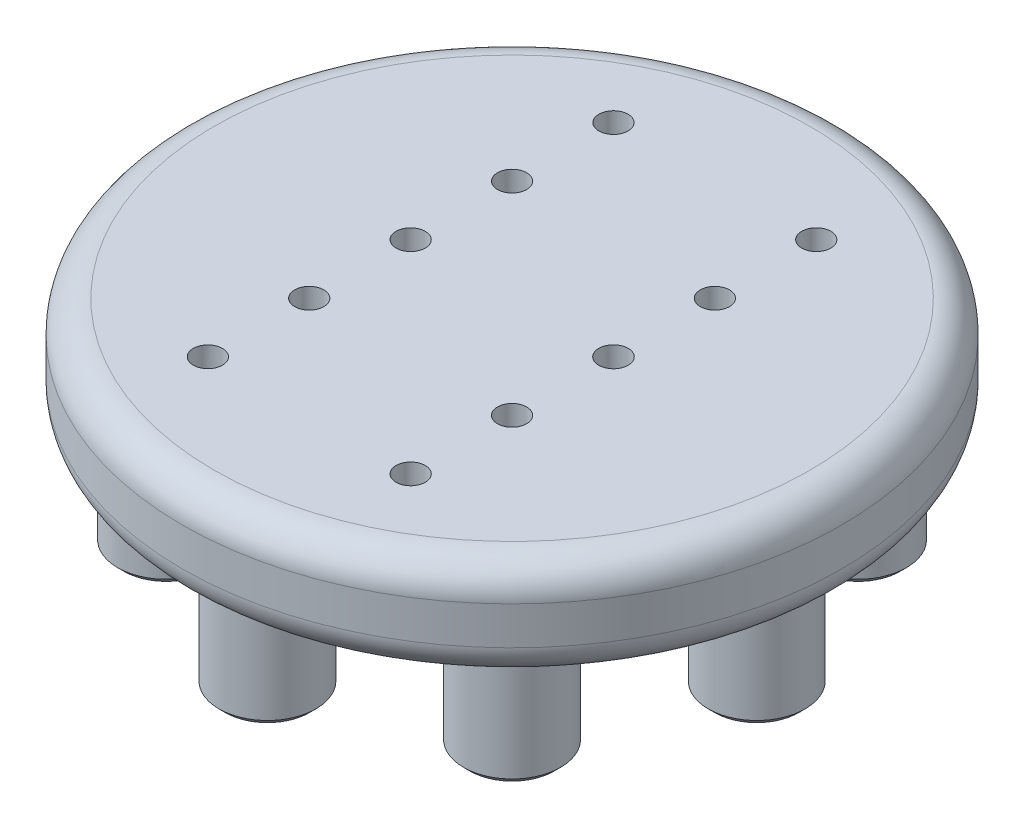
ISO-10303-21;
HEADER;
FILE_DESCRIPTION(('STEP AP214'),'2;1');
FILE_NAME('part.step','',(''),(''),'','','');
FILE_SCHEMA(('AUTOMOTIVE_DESIGN { 1 0 10303 214 1 1 1 1 }'));
ENDSEC;
DATA;
#1=APPLICATION_CONTEXT('core data for automotive mechanical design processes');
#2=APPLICATION_PROTOCOL_DEFINITION('international standard','automotive_design',2000,#1);
#3=PRODUCT_CONTEXT('',#1,'mechanical');
#4=PRODUCT('Part','Part','',(#3));
#5=PRODUCT_RELATED_PRODUCT_CATEGORY('part','',(#4));
#6=PRODUCT_DEFINITION_FORMATION('','',#4);
#7=PRODUCT_DEFINITION_CONTEXT('part definition',#1,'design');
#8=PRODUCT_DEFINITION('design','',#6,#7);
#9=PRODUCT_DEFINITION_SHAPE('','',#8);
#10=(LENGTH_UNIT() NAMED_UNIT(*) SI_UNIT(.MILLI.,.METRE.));
#11=(NAMED_UNIT(*) PLANE_ANGLE_UNIT() SI_UNIT($,.RADIAN.));
#12=(NAMED_UNIT(*) SI_UNIT($,.STERADIAN.) SOLID_ANGLE_UNIT());
#13=UNCERTAINTY_MEASURE_WITH_UNIT(LENGTH_MEASURE(1.E-05),#10,'distance_accuracy_value','');
#14=(GEOMETRIC_REPRESENTATION_CONTEXT(3) GLOBAL_UNCERTAINTY_ASSIGNED_CONTEXT((#13)) GLOBAL_UNIT_ASSIGNED_CONTEXT((#10,
#11,#12)) REPRESENTATION_CONTEXT('',''));
#15=CARTESIAN_POINT('',(0.,0.,0.));
#16=DIRECTION('',(0.,0.,1.));
#17=DIRECTION('',(1.,0.,0.));
#18=AXIS2_PLACEMENT_3D('',#15,#16,#17);
#19=CARTESIAN_POINT('',(0.,8.,0.));
#20=DIRECTION('',(0.,-1.,0.));
#21=DIRECTION('',(0.,0.,-1.));
#22=AXIS2_PLACEMENT_3D('',#19,#20,#21);
#23=CYLINDRICAL_SURFACE('',#22,26.);
#24=CARTESIAN_POINT('',(0.,2.5,0.));
#25=DIRECTION('',(0.,1.,0.));
#26=DIRECTION('',(0.,0.,1.));
#27=AXIS2_PLACEMENT_3D('',#24,#25,#26);
#28=CIRCLE('',#27,26.);
#29=CARTESIAN_POINT('',(0.,2.5,26.));
#30=VERTEX_POINT('',#29);
#31=EDGE_CURVE('E102',#30,#30,#28,.T.);
#32=ORIENTED_EDGE('',*,*,#31,.T.);
#33=EDGE_LOOP('',(#32));
#34=FACE_BOUND('',#33,.T.);
#35=CARTESIAN_POINT('',(0.,5.5,0.));
#36=DIRECTION('',(0.,1.,0.));
#37=DIRECTION('',(0.,0.,1.));
#38=AXIS2_PLACEMENT_3D('',#35,#36,#37);
#39=CIRCLE('',#38,26.);
#40=CARTESIAN_POINT('',(0.,5.5,26.));
#41=VERTEX_POINT('',#40);
#42=EDGE_CURVE('E105',#41,#41,#39,.F.);
#43=ORIENTED_EDGE('',*,*,#42,.T.);
#44=EDGE_LOOP('',(#43));
#45=FACE_BOUND('',#44,.T.);
#46=ADVANCED_FACE('F39',(#34,#45),#23,.T.);
#47=CARTESIAN_POINT('',(0.,8.,0.));
#48=DIRECTION('',(0.,1.,0.));
#49=DIRECTION('',(0.,0.,1.));
#50=AXIS2_PLACEMENT_3D('',#47,#48,#49);
#51=PLANE('',#50);
#52=CARTESIAN_POINT('',(8.,8.,8.));
#53=DIRECTION('',(0.,1.,0.));
#54=DIRECTION('',(0.,0.,1.));
#55=AXIS2_PLACEMENT_3D('',#52,#53,#54);
#56=CIRCLE('',#55,1.15);
#57=CARTESIAN_POINT('',(8.,8.,9.15));
#58=VERTEX_POINT('',#57);
#59=EDGE_CURVE('E161',#58,#58,#56,.T.);
#60=ORIENTED_EDGE('',*,*,#59,.F.);
#61=EDGE_LOOP('',(#60));
#62=FACE_BOUND('',#61,.T.);
#63=CARTESIAN_POINT('',(-8.,8.,16.));
#64=DIRECTION('',(0.,1.,0.));
#65=DIRECTION('',(0.,0.,1.));
#66=AXIS2_PLACEMENT_3D('',#63,#64,#65);
#67=CIRCLE('',#66,1.15);
#68=CARTESIAN_POINT('',(-8.,8.,17.15));
#69=VERTEX_POINT('',#68);
#70=EDGE_CURVE('E172',#69,#69,#67,.T.);
#71=ORIENTED_EDGE('',*,*,#70,.F.);
#72=EDGE_LOOP('',(#71));
#73=FACE_BOUND('',#72,.T.);
#74=CARTESIAN_POINT('',(8.,8.,16.));
#75=DIRECTION('',(0.,1.,0.));
#76=DIRECTION('',(0.,0.,1.));
#77=AXIS2_PLACEMENT_3D('',#74,#75,#76);
#78=CIRCLE('',#77,1.15);
#79=CARTESIAN_POINT('',(8.,8.,17.15));
#80=VERTEX_POINT('',#79);
#81=EDGE_CURVE('E173',#80,#80,#78,.T.);
#82=ORIENTED_EDGE('',*,*,#81,.F.);
#83=EDGE_LOOP('',(#82));
#84=FACE_BOUND('',#83,.T.);
#85=CARTESIAN_POINT('',(-8.,8.,0.));
#86=DIRECTION('',(0.,1.,0.));
#87=DIRECTION('',(0.,0.,1.));
#88=AXIS2_PLACEMENT_3D('',#85,#86,#87);
#89=CIRCLE('',#88,1.15);
#90=CARTESIAN_POINT('',(-8.,8.,1.15));
#91=VERTEX_POINT('',#90);
#92=EDGE_CURVE('E184',#91,#91,#89,.T.);
#93=ORIENTED_EDGE('',*,*,#92,.F.);
#94=EDGE_LOOP('',(#93));
#95=FACE_BOUND('',#94,.T.);
#96=CARTESIAN_POINT('',(-8.,8.,-8.));
#97=DIRECTION('',(0.,1.,0.));
#98=DIRECTION('',(0.,0.,1.));
#99=AXIS2_PLACEMENT_3D('',#96,#97,#98);
#100=CIRCLE('',#99,1.15);
#101=CARTESIAN_POINT('',(-8.,8.,-6.85));
#102=VERTEX_POINT('',#101);
#103=EDGE_CURVE('E142',#102,#102,#100,.T.);
#104=ORIENTED_EDGE('',*,*,#103,.F.);
#105=EDGE_LOOP('',(#104));
#106=FACE_BOUND('',#105,.T.);
#107=CARTESIAN_POINT('',(8.,8.,-16.));
#108=DIRECTION('',(0.,1.,0.));
#109=DIRECTION('',(0.,0.,1.));
#110=AXIS2_PLACEMENT_3D('',#107,#108,#109);
#111=CIRCLE('',#110,1.15);
#112=CARTESIAN_POINT('',(8.,8.,-14.85));
#113=VERTEX_POINT('',#112);
#114=EDGE_CURVE('E148',#113,#113,#111,.T.);
#115=ORIENTED_EDGE('',*,*,#114,.F.);
#116=EDGE_LOOP('',(#115));
#117=FACE_BOUND('',#116,.T.);
#118=CARTESIAN_POINT('',(8.,8.,-8.));
#119=DIRECTION('',(0.,1.,0.));
#120=DIRECTION('',(0.,0.,1.));
#121=AXIS2_PLACEMENT_3D('',#118,#119,#120);
#122=CIRCLE('',#121,1.15);
#123=CARTESIAN_POINT('',(8.,8.,-6.85));
#124=VERTEX_POINT('',#123);
#125=EDGE_CURVE('E149',#124,#124,#122,.T.);
#126=ORIENTED_EDGE('',*,*,#125,.F.);
#127=EDGE_LOOP('',(#126));
#128=FACE_BOUND('',#127,.T.);
#129=CARTESIAN_POINT('',(-8.,8.,8.));
#130=DIRECTION('',(0.,1.,0.));
#131=DIRECTION('',(0.,0.,1.));
#132=AXIS2_PLACEMENT_3D('',#129,#130,#131);
#133=CIRCLE('',#132,1.15);
#134=CARTESIAN_POINT('',(-8.,8.,9.15));
#135=VERTEX_POINT('',#134);
#136=EDGE_CURVE('E160',#135,#135,#133,.T.);
#137=ORIENTED_EDGE('',*,*,#136,.F.);
#138=EDGE_LOOP('',(#137));
#139=FACE_BOUND('',#138,.T.);
#140=CARTESIAN_POINT('',(8.,8.,0.));
#141=DIRECTION('',(0.,1.,0.));
#142=DIRECTION('',(0.,0.,1.));
#143=AXIS2_PLACEMENT_3D('',#140,#141,#142);
#144=CIRCLE('',#143,1.16019987262907);
#145=CARTESIAN_POINT('',(8.,8.,1.16019987262907));
#146=VERTEX_POINT('',#145);
#147=EDGE_CURVE('E185',#146,#146,#144,.T.);
#148=ORIENTED_EDGE('',*,*,#147,.F.);
#149=EDGE_LOOP('',(#148));
#150=FACE_BOUND('',#149,.T.);
#151=CARTESIAN_POINT('',(-8.,8.,-16.));
#152=DIRECTION('',(0.,1.,0.));
#153=DIRECTION('',(0.,0.,1.));
#154=AXIS2_PLACEMENT_3D('',#151,#152,#153);
#155=CIRCLE('',#154,1.15);
#156=CARTESIAN_POINT('',(-8.,8.,-14.85));
#157=VERTEX_POINT('',#156);
#158=EDGE_CURVE('E139',#157,#157,#155,.T.);
#159=ORIENTED_EDGE('',*,*,#158,.F.);
#160=EDGE_LOOP('',(#159));
#161=FACE_BOUND('',#160,.T.);
#162=CARTESIAN_POINT('',(0.,8.,0.));
#163=DIRECTION('',(0.,1.,0.));
#164=DIRECTION('',(0.,0.,1.));
#165=AXIS2_PLACEMENT_3D('',#162,#163,#164);
#166=CIRCLE('',#165,23.5);
#167=CARTESIAN_POINT('',(0.,8.,23.5));
#168=VERTEX_POINT('',#167);
#169=EDGE_CURVE('E96',#168,#168,#166,.T.);
#170=ORIENTED_EDGE('',*,*,#169,.T.);
#171=EDGE_LOOP('',(#170));
#172=FACE_BOUND('',#171,.T.);
#173=ADVANCED_FACE('F201',(#62,#73,#84,#95,#106,#117,#128,#139,#150,#161,#172),#51,.T.);
#174=CARTESIAN_POINT('',(0.,0.,0.));
#175=DIRECTION('',(0.,1.,0.));
#176=DIRECTION('',(0.,0.,1.));
#177=AXIS2_PLACEMENT_3D('',#174,#175,#176);
#178=PLANE('',#177);
#179=CARTESIAN_POINT('',(0.,0.,0.));
#180=DIRECTION('',(0.,1.,0.));
#181=DIRECTION('',(0.,0.,1.));
#182=AXIS2_PLACEMENT_3D('',#179,#180,#181);
#183=CIRCLE('',#182,23.5);
#184=CARTESIAN_POINT('',(0.,0.,23.5));
#185=VERTEX_POINT('',#184);
#186=EDGE_CURVE('E99',#185,#185,#183,.F.);
#187=ORIENTED_EDGE('',*,*,#186,.T.);
#188=EDGE_LOOP('',(#187));
#189=FACE_BOUND('',#188,.T.);
#190=CARTESIAN_POINT('',(-19.3,0.,0.));
#191=DIRECTION('',(0.,1.,0.));
#192=DIRECTION('',(0.,0.,1.));
#193=AXIS2_PLACEMENT_3D('',#190,#191,#192);
#194=CIRCLE('',#193,3.82);
#195=CARTESIAN_POINT('',(-19.3,0.,3.82));
#196=VERTEX_POINT('',#195);
#197=EDGE_CURVE('E135',#196,#196,#194,.T.);
#198=ORIENTED_EDGE('',*,*,#197,.T.);
#199=EDGE_LOOP('',(#198));
#200=FACE_BOUND('',#199,.T.);
#201=CARTESIAN_POINT('',(-13.6471608769004,0.,13.6471608769004));
#202=DIRECTION('',(0.,1.,0.));
#203=DIRECTION('',(0.,0.,1.));
#204=AXIS2_PLACEMENT_3D('',#201,#202,#203);
#205=CIRCLE('',#204,3.82);
#206=CARTESIAN_POINT('',(-13.6471608769004,0.,17.4671608769004));
#207=VERTEX_POINT('',#206);
#208=EDGE_CURVE('E132',#207,#207,#205,.T.);
#209=ORIENTED_EDGE('',*,*,#208,.T.);
#210=EDGE_LOOP('',(#209));
#211=FACE_BOUND('',#210,.T.);
#212=CARTESIAN_POINT('',(0.,0.,19.3));
#213=DIRECTION('',(0.,1.,0.));
#214=DIRECTION('',(0.,0.,1.));
#215=AXIS2_PLACEMENT_3D('',#212,#213,#214);
#216=CIRCLE('',#215,3.82);
#217=CARTESIAN_POINT('',(0.,0.,23.12));
#218=VERTEX_POINT('',#217);
#219=EDGE_CURVE('E129',#218,#218,#216,.T.);
#220=ORIENTED_EDGE('',*,*,#219,.T.);
#221=EDGE_LOOP('',(#220));
#222=FACE_BOUND('',#221,.T.);
#223=CARTESIAN_POINT('',(13.6471608769004,0.,13.6471608769004));
#224=DIRECTION('',(0.,1.,0.));
#225=DIRECTION('',(0.,0.,1.));
#226=AXIS2_PLACEMENT_3D('',#223,#224,#225);
#227=CIRCLE('',#226,3.82);
#228=CARTESIAN_POINT('',(13.6471608769004,0.,17.4671608769004));
#229=VERTEX_POINT('',#228);
#230=EDGE_CURVE('E126',#229,#229,#227,.T.);
#231=ORIENTED_EDGE('',*,*,#230,.T.);
#232=EDGE_LOOP('',(#231));
#233=FACE_BOUND('',#232,.T.);
#234=CARTESIAN_POINT('',(19.3,0.,0.));
#235=DIRECTION('',(0.,1.,0.));
#236=DIRECTION('',(0.,0.,1.));
#237=AXIS2_PLACEMENT_3D('',#234,#235,#236);
#238=CIRCLE('',#237,3.82);
#239=CARTESIAN_POINT('',(19.3,0.,3.82));
#240=VERTEX_POINT('',#239);
#241=EDGE_CURVE('E123',#240,#240,#238,.T.);
#242=ORIENTED_EDGE('',*,*,#241,.T.);
#243=EDGE_LOOP('',(#242));
#244=FACE_BOUND('',#243,.T.);
#245=CARTESIAN_POINT('',(13.6471608769005,0.,-13.6471608769007));
#246=DIRECTION('',(0.,1.,0.));
#247=DIRECTION('',(0.,0.,1.));
#248=AXIS2_PLACEMENT_3D('',#245,#246,#247);
#249=CIRCLE('',#248,3.82);
#250=CARTESIAN_POINT('',(13.6471608769005,0.,-9.82716087690073));
#251=VERTEX_POINT('',#250);
#252=EDGE_CURVE('E120',#251,#251,#249,.T.);
#253=ORIENTED_EDGE('',*,*,#252,.T.);
#254=EDGE_LOOP('',(#253));
#255=FACE_BOUND('',#254,.T.);
#256=CARTESIAN_POINT('',(0.,0.,-19.3));
#257=DIRECTION('',(0.,1.,0.));
#258=DIRECTION('',(0.,0.,1.));
#259=AXIS2_PLACEMENT_3D('',#256,#257,#258);
#260=CIRCLE('',#259,3.82);
#261=CARTESIAN_POINT('',(0.,0.,-15.48));
#262=VERTEX_POINT('',#261);
#263=EDGE_CURVE('E117',#262,#262,#260,.T.);
#264=ORIENTED_EDGE('',*,*,#263,.T.);
#265=EDGE_LOOP('',(#264));
#266=FACE_BOUND('',#265,.T.);
#267=CARTESIAN_POINT('',(-13.6471608769,0.,-13.6471608769002));
#268=DIRECTION('',(0.,1.,0.));
#269=DIRECTION('',(0.,0.,1.));
#270=AXIS2_PLACEMENT_3D('',#267,#268,#269);
#271=CIRCLE('',#270,3.82);
#272=CARTESIAN_POINT('',(-13.6471608769,0.,-9.82716087690015));
#273=VERTEX_POINT('',#272);
#274=EDGE_CURVE('E112',#273,#273,#271,.T.);
#275=ORIENTED_EDGE('',*,*,#274,.T.);
#276=EDGE_LOOP('',(#275));
#277=FACE_BOUND('',#276,.T.);
#278=CARTESIAN_POINT('',(0.,0.,0.));
#279=DIRECTION('',(0.,-1.,0.));
#280=DIRECTION('',(0.,0.,-1.));
#281=AXIS2_PLACEMENT_3D('',#278,#279,#280);
#282=CIRCLE('',#281,6.1);
#283=CARTESIAN_POINT('',(0.,0.,-6.1));
#284=VERTEX_POINT('',#283);
#285=EDGE_CURVE('E109',#284,#284,#282,.T.);
#286=ORIENTED_EDGE('',*,*,#285,.F.);
#287=EDGE_LOOP('',(#286));
#288=FACE_BOUND('',#287,.T.);
#289=ADVANCED_FACE('F204',(#189,#200,#211,#222,#233,#244,#255,#266,#277,#288),#178,.F.);
#290=CARTESIAN_POINT('',(0.,3.,0.));
#291=DIRECTION('',(0.,-1.,0.));
#292=DIRECTION('',(0.,0.,-1.));
#293=AXIS2_PLACEMENT_3D('',#290,#291,#292);
#294=CYLINDRICAL_SURFACE('',#293,6.1);
#295=CARTESIAN_POINT('',(0.,3.,0.));
#296=DIRECTION('',(0.,-1.,0.));
#297=DIRECTION('',(0.,0.,-1.));
#298=AXIS2_PLACEMENT_3D('',#295,#296,#297);
#299=CIRCLE('',#298,6.1);
#300=CARTESIAN_POINT('',(0.,3.,-6.1));
#301=VERTEX_POINT('',#300);
#302=EDGE_CURVE('E108',#301,#301,#299,.T.);
#303=ORIENTED_EDGE('',*,*,#302,.F.);
#304=EDGE_LOOP('',(#303));
#305=FACE_BOUND('',#304,.T.);
#306=ORIENTED_EDGE('',*,*,#285,.T.);
#307=EDGE_LOOP('',(#306));
#308=FACE_BOUND('',#307,.T.);
#309=ADVANCED_FACE('F237',(#305,#308),#294,.F.);
#310=CARTESIAN_POINT('',(0.,3.,0.));
#311=DIRECTION('',(0.,-1.,0.));
#312=DIRECTION('',(0.,0.,-1.));
#313=AXIS2_PLACEMENT_3D('',#310,#311,#312);
#314=PLANE('',#313);
#315=ORIENTED_EDGE('',*,*,#302,.T.);
#316=EDGE_LOOP('',(#315));
#317=FACE_BOUND('',#316,.T.);
#318=ADVANCED_FACE('F242',(#317),#314,.T.);
#319=CARTESIAN_POINT('',(-13.6471608769,-9.,-13.6471608769002));
#320=DIRECTION('',(0.,1.,0.));
#321=DIRECTION('',(0.,0.,1.));
#322=AXIS2_PLACEMENT_3D('',#319,#320,#321);
#323=CYLINDRICAL_SURFACE('',#322,3.82);
#324=CARTESIAN_POINT('',(-13.6471608769,-8.5,-13.6471608769002));
#325=DIRECTION('',(0.,1.,0.));
#326=DIRECTION('',(0.,0.,1.));
#327=AXIS2_PLACEMENT_3D('',#324,#325,#326);
#328=CIRCLE('',#327,3.82);
#329=CARTESIAN_POINT('',(-13.6471608769,-8.5,-9.82716087690015));
#330=VERTEX_POINT('',#329);
#331=EDGE_CURVE('E69',#330,#330,#328,.T.);
#332=ORIENTED_EDGE('',*,*,#331,.T.);
#333=EDGE_LOOP('',(#332));
#334=FACE_BOUND('',#333,.T.);
#335=ORIENTED_EDGE('',*,*,#274,.F.);
#336=EDGE_LOOP('',(#335));
#337=FACE_BOUND('',#336,.T.);
#338=ADVANCED_FACE('F246',(#334,#337),#323,.T.);
#339=CARTESIAN_POINT('',(-13.6471608769,-9.,-13.6471608769002));
#340=DIRECTION('',(0.,1.,0.));
#341=DIRECTION('',(0.,0.,1.));
#342=AXIS2_PLACEMENT_3D('',#339,#340,#341);
#343=PLANE('',#342);
#344=CARTESIAN_POINT('',(-13.6471608769,-9.,-13.6471608769002));
#345=DIRECTION('',(0.,1.,0.));
#346=DIRECTION('',(0.,0.,1.));
#347=AXIS2_PLACEMENT_3D('',#344,#345,#346);
#348=CIRCLE('',#347,3.32);
#349=CARTESIAN_POINT('',(-13.6471608769,-9.,-10.3271608769002));
#350=VERTEX_POINT('',#349);
#351=EDGE_CURVE('E66',#350,#350,#348,.F.);
#352=ORIENTED_EDGE('',*,*,#351,.T.);
#353=EDGE_LOOP('',(#352));
#354=FACE_BOUND('',#353,.T.);
#355=ADVANCED_FACE('F250',(#354),#343,.F.);
#356=CARTESIAN_POINT('',(0.,-9.,-19.3));
#357=DIRECTION('',(0.,1.,0.));
#358=DIRECTION('',(0.,0.,1.));
#359=AXIS2_PLACEMENT_3D('',#356,#357,#358);
#360=CYLINDRICAL_SURFACE('',#359,3.82);
#361=CARTESIAN_POINT('',(0.,-8.5,-19.3));
#362=DIRECTION('',(0.,1.,0.));
#363=DIRECTION('',(0.,0.,1.));
#364=AXIS2_PLACEMENT_3D('',#361,#362,#363);
#365=CIRCLE('',#364,3.82);
#366=CARTESIAN_POINT('',(0.,-8.5,-15.48));
#367=VERTEX_POINT('',#366);
#368=EDGE_CURVE('E63',#367,#367,#365,.T.);
#369=ORIENTED_EDGE('',*,*,#368,.T.);
#370=EDGE_LOOP('',(#369));
#371=FACE_BOUND('',#370,.T.);
#372=ORIENTED_EDGE('',*,*,#263,.F.);
#373=EDGE_LOOP('',(#372));
#374=FACE_BOUND('',#373,.T.);
#375=ADVANCED_FACE('F254',(#371,#374),#360,.T.);
#376=CARTESIAN_POINT('',(0.,-9.,-19.3));
#377=DIRECTION('',(0.,1.,0.));
#378=DIRECTION('',(0.,0.,1.));
#379=AXIS2_PLACEMENT_3D('',#376,#377,#378);
#380=PLANE('',#379);
#381=CARTESIAN_POINT('',(0.,-9.,-19.3));
#382=DIRECTION('',(0.,1.,0.));
#383=DIRECTION('',(0.,0.,1.));
#384=AXIS2_PLACEMENT_3D('',#381,#382,#383);
#385=CIRCLE('',#384,3.32);
#386=CARTESIAN_POINT('',(0.,-9.,-15.98));
#387=VERTEX_POINT('',#386);
#388=EDGE_CURVE('E60',#387,#387,#385,.F.);
#389=ORIENTED_EDGE('',*,*,#388,.T.);
#390=EDGE_LOOP('',(#389));
#391=FACE_BOUND('',#390,.T.);
#392=ADVANCED_FACE('F256',(#391),#380,.F.);
#393=CARTESIAN_POINT('',(13.6471608769005,-9.,-13.6471608769007));
#394=DIRECTION('',(0.,1.,0.));
#395=DIRECTION('',(0.,0.,1.));
#396=AXIS2_PLACEMENT_3D('',#393,#394,#395);
#397=CYLINDRICAL_SURFACE('',#396,3.82);
#398=CARTESIAN_POINT('',(13.6471608769005,-8.5,-13.6471608769007));
#399=DIRECTION('',(0.,1.,0.));
#400=DIRECTION('',(0.,0.,1.));
#401=AXIS2_PLACEMENT_3D('',#398,#399,#400);
#402=CIRCLE('',#401,3.82);
#403=CARTESIAN_POINT('',(13.6471608769005,-8.5,-9.82716087690073));
#404=VERTEX_POINT('',#403);
#405=EDGE_CURVE('E55',#404,#404,#402,.T.);
#406=ORIENTED_EDGE('',*,*,#405,.T.);
#407=EDGE_LOOP('',(#406));
#408=FACE_BOUND('',#407,.T.);
#409=ORIENTED_EDGE('',*,*,#252,.F.);
#410=EDGE_LOOP('',(#409));
#411=FACE_BOUND('',#410,.T.);
#412=ADVANCED_FACE('F259',(#408,#411),#397,.T.);
#413=CARTESIAN_POINT('',(13.6471608769005,-9.,-13.6471608769007));
#414=DIRECTION('',(0.,1.,0.));
#415=DIRECTION('',(0.,0.,1.));
#416=AXIS2_PLACEMENT_3D('',#413,#414,#415);
#417=PLANE('',#416);
#418=CARTESIAN_POINT('',(13.6471608769005,-9.,-13.6471608769007));
#419=DIRECTION('',(0.,1.,0.));
#420=DIRECTION('',(0.,0.,1.));
#421=AXIS2_PLACEMENT_3D('',#418,#419,#420);
#422=CIRCLE('',#421,3.32);
#423=CARTESIAN_POINT('',(13.6471608769005,-9.,-10.3271608769007));
#424=VERTEX_POINT('',#423);
#425=EDGE_CURVE('E51',#424,#424,#422,.F.);
#426=ORIENTED_EDGE('',*,*,#425,.T.);
#427=EDGE_LOOP('',(#426));
#428=FACE_BOUND('',#427,.T.);
#429=ADVANCED_FACE('F264',(#428),#417,.F.);
#430=CARTESIAN_POINT('',(19.3,-9.,0.));
#431=DIRECTION('',(0.,1.,0.));
#432=DIRECTION('',(0.,0.,1.));
#433=AXIS2_PLACEMENT_3D('',#430,#431,#432);
#434=CYLINDRICAL_SURFACE('',#433,3.82);
#435=CARTESIAN_POINT('',(19.3,-8.5,0.));
#436=DIRECTION('',(0.,1.,0.));
#437=DIRECTION('',(0.,0.,1.));
#438=AXIS2_PLACEMENT_3D('',#435,#436,#437);
#439=CIRCLE('',#438,3.82);
#440=CARTESIAN_POINT('',(19.3,-8.5,3.82));
#441=VERTEX_POINT('',#440);
#442=EDGE_CURVE('E47',#441,#441,#439,.T.);
#443=ORIENTED_EDGE('',*,*,#442,.T.);
#444=EDGE_LOOP('',(#443));
#445=FACE_BOUND('',#444,.T.);
#446=ORIENTED_EDGE('',*,*,#241,.F.);
#447=EDGE_LOOP('',(#446));
#448=FACE_BOUND('',#447,.T.);
#449=ADVANCED_FACE('F267',(#445,#448),#434,.T.);
#450=CARTESIAN_POINT('',(19.3,-9.,0.));
#451=DIRECTION('',(0.,1.,0.));
#452=DIRECTION('',(0.,0.,1.));
#453=AXIS2_PLACEMENT_3D('',#450,#451,#452);
#454=PLANE('',#453);
#455=CARTESIAN_POINT('',(19.3,-9.,0.));
#456=DIRECTION('',(0.,1.,0.));
#457=DIRECTION('',(0.,0.,1.));
#458=AXIS2_PLACEMENT_3D('',#455,#456,#457);
#459=CIRCLE('',#458,3.32);
#460=CARTESIAN_POINT('',(19.3,-9.,3.32));
#461=VERTEX_POINT('',#460);
#462=EDGE_CURVE('E10',#461,#461,#459,.F.);
#463=ORIENTED_EDGE('',*,*,#462,.T.);
#464=EDGE_LOOP('',(#463));
#465=FACE_BOUND('',#464,.T.);
#466=ADVANCED_FACE('F272',(#465),#454,.F.);
#467=CARTESIAN_POINT('',(13.6471608769004,-9.,13.6471608769004));
#468=DIRECTION('',(0.,1.,0.));
#469=DIRECTION('',(0.,0.,1.));
#470=AXIS2_PLACEMENT_3D('',#467,#468,#469);
#471=CYLINDRICAL_SURFACE('',#470,3.82);
#472=CARTESIAN_POINT('',(13.6471608769004,-8.50000000000001,13.6471608769004));
#473=DIRECTION('',(0.,1.,0.));
#474=DIRECTION('',(0.,0.,1.));
#475=AXIS2_PLACEMENT_3D('',#472,#473,#474);
#476=CIRCLE('',#475,3.82);
#477=CARTESIAN_POINT('',(13.6471608769004,-8.50000000000001,17.4671608769004));
#478=VERTEX_POINT('',#477);
#479=EDGE_CURVE('E87',#478,#478,#476,.T.);
#480=ORIENTED_EDGE('',*,*,#479,.T.);
#481=EDGE_LOOP('',(#480));
#482=FACE_BOUND('',#481,.T.);
#483=ORIENTED_EDGE('',*,*,#230,.F.);
#484=EDGE_LOOP('',(#483));
#485=FACE_BOUND('',#484,.T.);
#486=ADVANCED_FACE('F275',(#482,#485),#471,.T.);
#487=CARTESIAN_POINT('',(13.6471608769004,-9.,13.6471608769004));
#488=DIRECTION('',(0.,1.,0.));
#489=DIRECTION('',(0.,0.,1.));
#490=AXIS2_PLACEMENT_3D('',#487,#488,#489);
#491=PLANE('',#490);
#492=CARTESIAN_POINT('',(13.6471608769004,-9.,13.6471608769004));
#493=DIRECTION('',(0.,1.,0.));
#494=DIRECTION('',(0.,0.,1.));
#495=AXIS2_PLACEMENT_3D('',#492,#493,#494);
#496=CIRCLE('',#495,3.32000000000002);
#497=CARTESIAN_POINT('',(13.6471608769004,-9.,16.9671608769004));
#498=VERTEX_POINT('',#497);
#499=EDGE_CURVE('E84',#498,#498,#496,.F.);
#500=ORIENTED_EDGE('',*,*,#499,.T.);
#501=EDGE_LOOP('',(#500));
#502=FACE_BOUND('',#501,.T.);
#503=ADVANCED_FACE('F278',(#502),#491,.F.);
#504=CARTESIAN_POINT('',(0.,-9.,19.3));
#505=DIRECTION('',(0.,1.,0.));
#506=DIRECTION('',(0.,0.,1.));
#507=AXIS2_PLACEMENT_3D('',#504,#505,#506);
#508=CYLINDRICAL_SURFACE('',#507,3.82);
#509=CARTESIAN_POINT('',(0.,-8.5,19.3));
#510=DIRECTION('',(0.,1.,0.));
#511=DIRECTION('',(0.,0.,1.));
#512=AXIS2_PLACEMENT_3D('',#509,#510,#511);
#513=CIRCLE('',#512,3.82);
#514=CARTESIAN_POINT('',(0.,-8.5,23.12));
#515=VERTEX_POINT('',#514);
#516=EDGE_CURVE('E93',#515,#515,#513,.T.);
#517=ORIENTED_EDGE('',*,*,#516,.T.);
#518=EDGE_LOOP('',(#517));
#519=FACE_BOUND('',#518,.T.);
#520=ORIENTED_EDGE('',*,*,#219,.F.);
#521=EDGE_LOOP('',(#520));
#522=FACE_BOUND('',#521,.T.);
#523=ADVANCED_FACE('F281',(#519,#522),#508,.T.);
#524=CARTESIAN_POINT('',(0.,-9.,19.3));
#525=DIRECTION('',(0.,1.,0.));
#526=DIRECTION('',(0.,0.,1.));
#527=AXIS2_PLACEMENT_3D('',#524,#525,#526);
#528=PLANE('',#527);
#529=CARTESIAN_POINT('',(0.,-9.,19.3));
#530=DIRECTION('',(0.,1.,0.));
#531=DIRECTION('',(0.,0.,1.));
#532=AXIS2_PLACEMENT_3D('',#529,#530,#531);
#533=CIRCLE('',#532,3.32);
#534=CARTESIAN_POINT('',(0.,-9.,22.62));
#535=VERTEX_POINT('',#534);
#536=EDGE_CURVE('E90',#535,#535,#533,.F.);
#537=ORIENTED_EDGE('',*,*,#536,.T.);
#538=EDGE_LOOP('',(#537));
#539=FACE_BOUND('',#538,.T.);
#540=ADVANCED_FACE('F286',(#539),#528,.F.);
#541=CARTESIAN_POINT('',(-13.6471608769004,-9.,13.6471608769004));
#542=DIRECTION('',(0.,1.,0.));
#543=DIRECTION('',(0.,0.,1.));
#544=AXIS2_PLACEMENT_3D('',#541,#542,#543);
#545=CYLINDRICAL_SURFACE('',#544,3.82);
#546=CARTESIAN_POINT('',(-13.6471608769004,-8.5,13.6471608769004));
#547=DIRECTION('',(0.,1.,0.));
#548=DIRECTION('',(0.,0.,1.));
#549=AXIS2_PLACEMENT_3D('',#546,#547,#548);
#550=CIRCLE('',#549,3.82);
#551=CARTESIAN_POINT('',(-13.6471608769004,-8.5,17.4671608769004));
#552=VERTEX_POINT('',#551);
#553=EDGE_CURVE('E81',#552,#552,#550,.T.);
#554=ORIENTED_EDGE('',*,*,#553,.T.);
#555=EDGE_LOOP('',(#554));
#556=FACE_BOUND('',#555,.T.);
#557=ORIENTED_EDGE('',*,*,#208,.F.);
#558=EDGE_LOOP('',(#557));
#559=FACE_BOUND('',#558,.T.);
#560=ADVANCED_FACE('F289',(#556,#559),#545,.T.);
#561=CARTESIAN_POINT('',(-13.6471608769004,-9.,13.6471608769004));
#562=DIRECTION('',(0.,1.,0.));
#563=DIRECTION('',(0.,0.,1.));
#564=AXIS2_PLACEMENT_3D('',#561,#562,#563);
#565=PLANE('',#564);
#566=CARTESIAN_POINT('',(-13.6471608769004,-9.,13.6471608769004));
#567=DIRECTION('',(0.,1.,0.));
#568=DIRECTION('',(0.,0.,1.));
#569=AXIS2_PLACEMENT_3D('',#566,#567,#568);
#570=CIRCLE('',#569,3.32);
#571=CARTESIAN_POINT('',(-13.6471608769004,-9.,16.9671608769004));
#572=VERTEX_POINT('',#571);
#573=EDGE_CURVE('E78',#572,#572,#570,.F.);
#574=ORIENTED_EDGE('',*,*,#573,.T.);
#575=EDGE_LOOP('',(#574));
#576=FACE_BOUND('',#575,.T.);
#577=ADVANCED_FACE('F294',(#576),#565,.F.);
#578=CARTESIAN_POINT('',(-19.3,-9.,0.));
#579=DIRECTION('',(0.,1.,0.));
#580=DIRECTION('',(0.,0.,1.));
#581=AXIS2_PLACEMENT_3D('',#578,#579,#580);
#582=CYLINDRICAL_SURFACE('',#581,3.82);
#583=CARTESIAN_POINT('',(-19.3,-8.5,0.));
#584=DIRECTION('',(0.,1.,0.));
#585=DIRECTION('',(0.,0.,1.));
#586=AXIS2_PLACEMENT_3D('',#583,#584,#585);
#587=CIRCLE('',#586,3.82);
#588=CARTESIAN_POINT('',(-19.3,-8.5,3.82));
#589=VERTEX_POINT('',#588);
#590=EDGE_CURVE('E75',#589,#589,#587,.T.);
#591=ORIENTED_EDGE('',*,*,#590,.T.);
#592=EDGE_LOOP('',(#591));
#593=FACE_BOUND('',#592,.T.);
#594=ORIENTED_EDGE('',*,*,#197,.F.);
#595=EDGE_LOOP('',(#594));
#596=FACE_BOUND('',#595,.T.);
#597=ADVANCED_FACE('F297',(#593,#596),#582,.T.);
#598=CARTESIAN_POINT('',(-19.3,-9.,0.));
#599=DIRECTION('',(0.,1.,0.));
#600=DIRECTION('',(0.,0.,1.));
#601=AXIS2_PLACEMENT_3D('',#598,#599,#600);
#602=PLANE('',#601);
#603=CARTESIAN_POINT('',(-19.3,-9.,0.));
#604=DIRECTION('',(0.,1.,0.));
#605=DIRECTION('',(0.,0.,1.));
#606=AXIS2_PLACEMENT_3D('',#603,#604,#605);
#607=CIRCLE('',#606,3.32);
#608=CARTESIAN_POINT('',(-19.3,-9.,3.32));
#609=VERTEX_POINT('',#608);
#610=EDGE_CURVE('E72',#609,#609,#607,.F.);
#611=ORIENTED_EDGE('',*,*,#610,.T.);
#612=EDGE_LOOP('',(#611));
#613=FACE_BOUND('',#612,.T.);
#614=ADVANCED_FACE('F224',(#613),#602,.F.);
#615=CARTESIAN_POINT('',(0.,2.5,0.));
#616=DIRECTION('',(0.,1.,0.));
#617=DIRECTION('',(0.,0.,1.));
#618=AXIS2_PLACEMENT_3D('',#615,#616,#617);
#619=TOROIDAL_SURFACE('',#618,23.5,2.5);
#620=ORIENTED_EDGE('',*,*,#186,.F.);
#621=EDGE_LOOP('',(#620));
#622=FACE_BOUND('',#621,.T.);
#623=ORIENTED_EDGE('',*,*,#31,.F.);
#624=EDGE_LOOP('',(#623));
#625=FACE_BOUND('',#624,.T.);
#626=ADVANCED_FACE('F214',(#622,#625),#619,.T.);
#627=CARTESIAN_POINT('',(0.,5.5,0.));
#628=DIRECTION('',(0.,1.,0.));
#629=DIRECTION('',(0.,0.,1.));
#630=AXIS2_PLACEMENT_3D('',#627,#628,#629);
#631=TOROIDAL_SURFACE('',#630,23.5,2.5);
#632=ORIENTED_EDGE('',*,*,#42,.F.);
#633=EDGE_LOOP('',(#632));
#634=FACE_BOUND('',#633,.T.);
#635=ORIENTED_EDGE('',*,*,#169,.F.);
#636=EDGE_LOOP('',(#635));
#637=FACE_BOUND('',#636,.T.);
#638=ADVANCED_FACE('F211',(#634,#637),#631,.T.);
#639=CARTESIAN_POINT('',(-8.,2.,-16.));
#640=DIRECTION('',(0.,1.,0.));
#641=DIRECTION('',(0.,0.,1.));
#642=AXIS2_PLACEMENT_3D('',#639,#640,#641);
#643=CYLINDRICAL_SURFACE('',#642,1.15);
#644=CARTESIAN_POINT('',(-8.,2.,-16.));
#645=DIRECTION('',(0.,1.,0.));
#646=DIRECTION('',(0.,0.,1.));
#647=AXIS2_PLACEMENT_3D('',#644,#645,#646);
#648=CIRCLE('',#647,1.15);
#649=CARTESIAN_POINT('',(-8.,2.,-14.85));
#650=VERTEX_POINT('',#649);
#651=EDGE_CURVE('E138',#650,#650,#648,.T.);
#652=ORIENTED_EDGE('',*,*,#651,.F.);
#653=EDGE_LOOP('',(#652));
#654=FACE_BOUND('',#653,.T.);
#655=ORIENTED_EDGE('',*,*,#158,.T.);
#656=EDGE_LOOP('',(#655));
#657=FACE_BOUND('',#656,.T.);
#658=ADVANCED_FACE('F213',(#654,#657),#643,.F.);
#659=CARTESIAN_POINT('',(-8.,2.,-16.));
#660=DIRECTION('',(0.,1.,0.));
#661=DIRECTION('',(0.,0.,1.));
#662=AXIS2_PLACEMENT_3D('',#659,#660,#661);
#663=PLANE('',#662);
#664=ORIENTED_EDGE('',*,*,#651,.T.);
#665=EDGE_LOOP('',(#664));
#666=FACE_BOUND('',#665,.T.);
#667=ADVANCED_FACE('F221',(#666),#663,.T.);
#668=CARTESIAN_POINT('',(8.,2.,0.));
#669=DIRECTION('',(0.,1.,0.));
#670=DIRECTION('',(0.,0.,1.));
#671=AXIS2_PLACEMENT_3D('',#668,#669,#670);
#672=CYLINDRICAL_SURFACE('',#671,1.16019987262907);
#673=CARTESIAN_POINT('',(8.,2.,0.));
#674=DIRECTION('',(0.,1.,0.));
#675=DIRECTION('',(0.,0.,1.));
#676=AXIS2_PLACEMENT_3D('',#673,#674,#675);
#677=CIRCLE('',#676,1.16019987262907);
#678=CARTESIAN_POINT('',(8.,2.,1.16019987262907));
#679=VERTEX_POINT('',#678);
#680=EDGE_CURVE('E193',#679,#679,#677,.T.);
#681=ORIENTED_EDGE('',*,*,#680,.F.);
#682=EDGE_LOOP('',(#681));
#683=FACE_BOUND('',#682,.T.);
#684=ORIENTED_EDGE('',*,*,#147,.T.);
#685=EDGE_LOOP('',(#684));
#686=FACE_BOUND('',#685,.T.);
#687=ADVANCED_FACE('F199',(#683,#686),#672,.F.);
#688=CARTESIAN_POINT('',(8.,2.,0.));
#689=DIRECTION('',(0.,1.,0.));
#690=DIRECTION('',(0.,0.,1.));
#691=AXIS2_PLACEMENT_3D('',#688,#689,#690);
#692=PLANE('',#691);
#693=ORIENTED_EDGE('',*,*,#680,.T.);
#694=EDGE_LOOP('',(#693));
#695=FACE_BOUND('',#694,.T.);
#696=ADVANCED_FACE('F337',(#695),#692,.T.);
#697=CARTESIAN_POINT('',(-8.,2.,8.));
#698=DIRECTION('',(0.,1.,0.));
#699=DIRECTION('',(0.,0.,1.));
#700=AXIS2_PLACEMENT_3D('',#697,#698,#699);
#701=CYLINDRICAL_SURFACE('',#700,1.15);
#702=CARTESIAN_POINT('',(-8.,2.,8.));
#703=DIRECTION('',(0.,1.,0.));
#704=DIRECTION('',(0.,0.,1.));
#705=AXIS2_PLACEMENT_3D('',#702,#703,#704);
#706=CIRCLE('',#705,1.15);
#707=CARTESIAN_POINT('',(-8.,2.,9.15));
#708=VERTEX_POINT('',#707);
#709=EDGE_CURVE('E157',#708,#708,#706,.T.);
#710=ORIENTED_EDGE('',*,*,#709,.F.);
#711=EDGE_LOOP('',(#710));
#712=FACE_BOUND('',#711,.T.);
#713=ORIENTED_EDGE('',*,*,#136,.T.);
#714=EDGE_LOOP('',(#713));
#715=FACE_BOUND('',#714,.T.);
#716=ADVANCED_FACE('F333',(#712,#715),#701,.F.);
#717=CARTESIAN_POINT('',(-8.,2.,8.));
#718=DIRECTION('',(0.,1.,0.));
#719=DIRECTION('',(0.,0.,1.));
#720=AXIS2_PLACEMENT_3D('',#717,#718,#719);
#721=PLANE('',#720);
#722=ORIENTED_EDGE('',*,*,#709,.T.);
#723=EDGE_LOOP('',(#722));
#724=FACE_BOUND('',#723,.T.);
#725=ADVANCED_FACE('F329',(#724),#721,.T.);
#726=CARTESIAN_POINT('',(8.,2.,-8.));
#727=DIRECTION('',(0.,1.,0.));
#728=DIRECTION('',(0.,0.,1.));
#729=AXIS2_PLACEMENT_3D('',#726,#727,#728);
#730=CYLINDRICAL_SURFACE('',#729,1.15);
#731=CARTESIAN_POINT('',(8.,2.,-8.));
#732=DIRECTION('',(0.,1.,0.));
#733=DIRECTION('',(0.,0.,1.));
#734=AXIS2_PLACEMENT_3D('',#731,#732,#733);
#735=CIRCLE('',#734,1.15);
#736=CARTESIAN_POINT('',(8.,2.,-6.85));
#737=VERTEX_POINT('',#736);
#738=EDGE_CURVE('E164',#737,#737,#735,.T.);
#739=ORIENTED_EDGE('',*,*,#738,.F.);
#740=EDGE_LOOP('',(#739));
#741=FACE_BOUND('',#740,.T.);
#742=ORIENTED_EDGE('',*,*,#125,.T.);
#743=EDGE_LOOP('',(#742));
#744=FACE_BOUND('',#743,.T.);
#745=ADVANCED_FACE('F332',(#741,#744),#730,.F.);
#746=CARTESIAN_POINT('',(8.,2.,-8.));
#747=DIRECTION('',(0.,1.,0.));
#748=DIRECTION('',(0.,0.,1.));
#749=AXIS2_PLACEMENT_3D('',#746,#747,#748);
#750=PLANE('',#749);
#751=ORIENTED_EDGE('',*,*,#738,.T.);
#752=EDGE_LOOP('',(#751));
#753=FACE_BOUND('',#752,.T.);
#754=ADVANCED_FACE('F319',(#753),#750,.T.);
#755=CARTESIAN_POINT('',(8.,2.,-16.));
#756=DIRECTION('',(0.,1.,0.));
#757=DIRECTION('',(0.,0.,1.));
#758=AXIS2_PLACEMENT_3D('',#755,#756,#757);
#759=CYLINDRICAL_SURFACE('',#758,1.15);
#760=CARTESIAN_POINT('',(8.,2.,-16.));
#761=DIRECTION('',(0.,1.,0.));
#762=DIRECTION('',(0.,0.,1.));
#763=AXIS2_PLACEMENT_3D('',#760,#761,#762);
#764=CIRCLE('',#763,1.15);
#765=CARTESIAN_POINT('',(8.,2.,-14.85));
#766=VERTEX_POINT('',#765);
#767=EDGE_CURVE('E145',#766,#766,#764,.T.);
#768=ORIENTED_EDGE('',*,*,#767,.F.);
#769=EDGE_LOOP('',(#768));
#770=FACE_BOUND('',#769,.T.);
#771=ORIENTED_EDGE('',*,*,#114,.T.);
#772=EDGE_LOOP('',(#771));
#773=FACE_BOUND('',#772,.T.);
#774=ADVANCED_FACE('F315',(#770,#773),#759,.F.);
#775=CARTESIAN_POINT('',(8.,2.,-16.));
#776=DIRECTION('',(0.,1.,0.));
#777=DIRECTION('',(0.,0.,1.));
#778=AXIS2_PLACEMENT_3D('',#775,#776,#777);
#779=PLANE('',#778);
#780=ORIENTED_EDGE('',*,*,#767,.T.);
#781=EDGE_LOOP('',(#780));
#782=FACE_BOUND('',#781,.T.);
#783=ADVANCED_FACE('F311',(#782),#779,.T.);
#784=CARTESIAN_POINT('',(-8.,2.,-8.));
#785=DIRECTION('',(0.,1.,0.));
#786=DIRECTION('',(0.,0.,1.));
#787=AXIS2_PLACEMENT_3D('',#784,#785,#786);
#788=CYLINDRICAL_SURFACE('',#787,1.15);
#789=CARTESIAN_POINT('',(-8.,2.,-8.));
#790=DIRECTION('',(0.,1.,0.));
#791=DIRECTION('',(0.,0.,1.));
#792=AXIS2_PLACEMENT_3D('',#789,#790,#791);
#793=CIRCLE('',#792,1.15);
#794=CARTESIAN_POINT('',(-8.,2.,-6.85));
#795=VERTEX_POINT('',#794);
#796=EDGE_CURVE('E152',#795,#795,#793,.T.);
#797=ORIENTED_EDGE('',*,*,#796,.F.);
#798=EDGE_LOOP('',(#797));
#799=FACE_BOUND('',#798,.T.);
#800=ORIENTED_EDGE('',*,*,#103,.T.);
#801=EDGE_LOOP('',(#800));
#802=FACE_BOUND('',#801,.T.);
#803=ADVANCED_FACE('F314',(#799,#802),#788,.F.);
#804=CARTESIAN_POINT('',(-8.,2.,-8.));
#805=DIRECTION('',(0.,1.,0.));
#806=DIRECTION('',(0.,0.,1.));
#807=AXIS2_PLACEMENT_3D('',#804,#805,#806);
#808=PLANE('',#807);
#809=ORIENTED_EDGE('',*,*,#796,.T.);
#810=EDGE_LOOP('',(#809));
#811=FACE_BOUND('',#810,.T.);
#812=ADVANCED_FACE('F321',(#811),#808,.T.);
#813=CARTESIAN_POINT('',(-8.,2.,0.));
#814=DIRECTION('',(0.,1.,0.));
#815=DIRECTION('',(0.,0.,1.));
#816=AXIS2_PLACEMENT_3D('',#813,#814,#815);
#817=CYLINDRICAL_SURFACE('',#816,1.15);
#818=CARTESIAN_POINT('',(-8.,2.,0.));
#819=DIRECTION('',(0.,1.,0.));
#820=DIRECTION('',(0.,0.,1.));
#821=AXIS2_PLACEMENT_3D('',#818,#819,#820);
#822=CIRCLE('',#821,1.15);
#823=CARTESIAN_POINT('',(-8.,2.,1.15));
#824=VERTEX_POINT('',#823);
#825=EDGE_CURVE('E181',#824,#824,#822,.T.);
#826=ORIENTED_EDGE('',*,*,#825,.F.);
#827=EDGE_LOOP('',(#826));
#828=FACE_BOUND('',#827,.T.);
#829=ORIENTED_EDGE('',*,*,#92,.T.);
#830=EDGE_LOOP('',(#829));
#831=FACE_BOUND('',#830,.T.);
#832=ADVANCED_FACE('F324',(#828,#831),#817,.F.);
#833=CARTESIAN_POINT('',(-8.,2.,0.));
#834=DIRECTION('',(0.,1.,0.));
#835=DIRECTION('',(0.,0.,1.));
#836=AXIS2_PLACEMENT_3D('',#833,#834,#835);
#837=PLANE('',#836);
#838=ORIENTED_EDGE('',*,*,#825,.T.);
#839=EDGE_LOOP('',(#838));
#840=FACE_BOUND('',#839,.T.);
#841=ADVANCED_FACE('F363',(#840),#837,.T.);
#842=CARTESIAN_POINT('',(8.,2.,16.));
#843=DIRECTION('',(0.,1.,0.));
#844=DIRECTION('',(0.,0.,1.));
#845=AXIS2_PLACEMENT_3D('',#842,#843,#844);
#846=CYLINDRICAL_SURFACE('',#845,1.15);
#847=CARTESIAN_POINT('',(8.,2.,16.));
#848=DIRECTION('',(0.,1.,0.));
#849=DIRECTION('',(0.,0.,1.));
#850=AXIS2_PLACEMENT_3D('',#847,#848,#849);
#851=CIRCLE('',#850,1.15);
#852=CARTESIAN_POINT('',(8.,2.,17.15));
#853=VERTEX_POINT('',#852);
#854=EDGE_CURVE('E188',#853,#853,#851,.T.);
#855=ORIENTED_EDGE('',*,*,#854,.F.);
#856=EDGE_LOOP('',(#855));
#857=FACE_BOUND('',#856,.T.);
#858=ORIENTED_EDGE('',*,*,#81,.T.);
#859=EDGE_LOOP('',(#858));
#860=FACE_BOUND('',#859,.T.);
#861=ADVANCED_FACE('F366',(#857,#860),#846,.F.);
#862=CARTESIAN_POINT('',(8.,2.,16.));
#863=DIRECTION('',(0.,1.,0.));
#864=DIRECTION('',(0.,0.,1.));
#865=AXIS2_PLACEMENT_3D('',#862,#863,#864);
#866=PLANE('',#865);
#867=ORIENTED_EDGE('',*,*,#854,.T.);
#868=EDGE_LOOP('',(#867));
#869=FACE_BOUND('',#868,.T.);
#870=ADVANCED_FACE('F353',(#869),#866,.T.);
#871=CARTESIAN_POINT('',(-8.,2.,16.));
#872=DIRECTION('',(0.,1.,0.));
#873=DIRECTION('',(0.,0.,1.));
#874=AXIS2_PLACEMENT_3D('',#871,#872,#873);
#875=CYLINDRICAL_SURFACE('',#874,1.15);
#876=CARTESIAN_POINT('',(-8.,2.,16.));
#877=DIRECTION('',(0.,1.,0.));
#878=DIRECTION('',(0.,0.,1.));
#879=AXIS2_PLACEMENT_3D('',#876,#877,#878);
#880=CIRCLE('',#879,1.15);
#881=CARTESIAN_POINT('',(-8.,2.,17.15));
#882=VERTEX_POINT('',#881);
#883=EDGE_CURVE('E169',#882,#882,#880,.T.);
#884=ORIENTED_EDGE('',*,*,#883,.F.);
#885=EDGE_LOOP('',(#884));
#886=FACE_BOUND('',#885,.T.);
#887=ORIENTED_EDGE('',*,*,#70,.T.);
#888=EDGE_LOOP('',(#887));
#889=FACE_BOUND('',#888,.T.);
#890=ADVANCED_FACE('F349',(#886,#889),#875,.F.);
#891=CARTESIAN_POINT('',(-8.,2.,16.));
#892=DIRECTION('',(0.,1.,0.));
#893=DIRECTION('',(0.,0.,1.));
#894=AXIS2_PLACEMENT_3D('',#891,#892,#893);
#895=PLANE('',#894);
#896=ORIENTED_EDGE('',*,*,#883,.T.);
#897=EDGE_LOOP('',(#896));
#898=FACE_BOUND('',#897,.T.);
#899=ADVANCED_FACE('F345',(#898),#895,.T.);
#900=CARTESIAN_POINT('',(8.,2.,8.));
#901=DIRECTION('',(0.,1.,0.));
#902=DIRECTION('',(0.,0.,1.));
#903=AXIS2_PLACEMENT_3D('',#900,#901,#902);
#904=CYLINDRICAL_SURFACE('',#903,1.15);
#905=CARTESIAN_POINT('',(8.,2.,8.));
#906=DIRECTION('',(0.,1.,0.));
#907=DIRECTION('',(0.,0.,1.));
#908=AXIS2_PLACEMENT_3D('',#905,#906,#907);
#909=CIRCLE('',#908,1.15);
#910=CARTESIAN_POINT('',(8.,2.,9.15));
#911=VERTEX_POINT('',#910);
#912=EDGE_CURVE('E176',#911,#911,#909,.T.);
#913=ORIENTED_EDGE('',*,*,#912,.F.);
#914=EDGE_LOOP('',(#913));
#915=FACE_BOUND('',#914,.T.);
#916=ORIENTED_EDGE('',*,*,#59,.T.);
#917=EDGE_LOOP('',(#916));
#918=FACE_BOUND('',#917,.T.);
#919=ADVANCED_FACE('F348',(#915,#918),#904,.F.);
#920=CARTESIAN_POINT('',(8.,2.,8.));
#921=DIRECTION('',(0.,1.,0.));
#922=DIRECTION('',(0.,0.,1.));
#923=AXIS2_PLACEMENT_3D('',#920,#921,#922);
#924=PLANE('',#923);
#925=ORIENTED_EDGE('',*,*,#912,.T.);
#926=EDGE_LOOP('',(#925));
#927=FACE_BOUND('',#926,.T.);
#928=ADVANCED_FACE('F355',(#927),#924,.T.);
#929=CARTESIAN_POINT('',(0.,-8.5,19.3));
#930=DIRECTION('',(0.,1.,0.));
#931=DIRECTION('',(0.,0.,1.));
#932=AXIS2_PLACEMENT_3D('',#929,#930,#931);
#933=CONICAL_SURFACE('',#932,3.82,0.785398163397455);
#934=ORIENTED_EDGE('',*,*,#536,.F.);
#935=EDGE_LOOP('',(#934));
#936=FACE_BOUND('',#935,.T.);
#937=ORIENTED_EDGE('',*,*,#516,.F.);
#938=EDGE_LOOP('',(#937));
#939=FACE_BOUND('',#938,.T.);
#940=ADVANCED_FACE('F358',(#936,#939),#933,.T.);
#941=CARTESIAN_POINT('',(13.6471608769004,-8.50000000000001,13.6471608769004));
#942=DIRECTION('',(0.,1.,0.));
#943=DIRECTION('',(0.,0.,1.));
#944=AXIS2_PLACEMENT_3D('',#941,#942,#943);
#945=CONICAL_SURFACE('',#944,3.82,0.785398163397441);
#946=ORIENTED_EDGE('',*,*,#499,.F.);
#947=EDGE_LOOP('',(#946));
#948=FACE_BOUND('',#947,.T.);
#949=ORIENTED_EDGE('',*,*,#479,.F.);
#950=EDGE_LOOP('',(#949));
#951=FACE_BOUND('',#950,.T.);
#952=ADVANCED_FACE('F462',(#948,#951),#945,.T.);
#953=CARTESIAN_POINT('',(-13.6471608769004,-8.5,13.6471608769004));
#954=DIRECTION('',(0.,1.,0.));
#955=DIRECTION('',(0.,0.,1.));
#956=AXIS2_PLACEMENT_3D('',#953,#954,#955);
#957=CONICAL_SURFACE('',#956,3.82,0.785398163397455);
#958=ORIENTED_EDGE('',*,*,#573,.F.);
#959=EDGE_LOOP('',(#958));
#960=FACE_BOUND('',#959,.T.);
#961=ORIENTED_EDGE('',*,*,#553,.F.);
#962=EDGE_LOOP('',(#961));
#963=FACE_BOUND('',#962,.T.);
#964=ADVANCED_FACE('F470',(#960,#963),#957,.T.);
#965=CARTESIAN_POINT('',(-19.3,-8.5,0.));
#966=DIRECTION('',(0.,1.,0.));
#967=DIRECTION('',(0.,0.,1.));
#968=AXIS2_PLACEMENT_3D('',#965,#966,#967);
#969=CONICAL_SURFACE('',#968,3.82,0.785398163397455);
#970=ORIENTED_EDGE('',*,*,#610,.F.);
#971=EDGE_LOOP('',(#970));
#972=FACE_BOUND('',#971,.T.);
#973=ORIENTED_EDGE('',*,*,#590,.F.);
#974=EDGE_LOOP('',(#973));
#975=FACE_BOUND('',#974,.T.);
#976=ADVANCED_FACE('F478',(#972,#975),#969,.T.);
#977=CARTESIAN_POINT('',(-13.6471608769,-8.5,-13.6471608769002));
#978=DIRECTION('',(0.,1.,0.));
#979=DIRECTION('',(0.,0.,1.));
#980=AXIS2_PLACEMENT_3D('',#977,#978,#979);
#981=CONICAL_SURFACE('',#980,3.82,0.785398163397455);
#982=ORIENTED_EDGE('',*,*,#351,.F.);
#983=EDGE_LOOP('',(#982));
#984=FACE_BOUND('',#983,.T.);
#985=ORIENTED_EDGE('',*,*,#331,.F.);
#986=EDGE_LOOP('',(#985));
#987=FACE_BOUND('',#986,.T.);
#988=ADVANCED_FACE('F486',(#984,#987),#981,.T.);
#989=CARTESIAN_POINT('',(0.,-8.5,-19.3));
#990=DIRECTION('',(0.,1.,0.));
#991=DIRECTION('',(0.,0.,1.));
#992=AXIS2_PLACEMENT_3D('',#989,#990,#991);
#993=CONICAL_SURFACE('',#992,3.82,0.785398163397455);
#994=ORIENTED_EDGE('',*,*,#388,.F.);
#995=EDGE_LOOP('',(#994));
#996=FACE_BOUND('',#995,.T.);
#997=ORIENTED_EDGE('',*,*,#368,.F.);
#998=EDGE_LOOP('',(#997));
#999=FACE_BOUND('',#998,.T.);
#1000=ADVANCED_FACE('F494',(#996,#999),#993,.T.);
#1001=CARTESIAN_POINT('',(13.6471608769005,-8.5,-13.6471608769007));
#1002=DIRECTION('',(0.,1.,0.));
#1003=DIRECTION('',(0.,0.,1.));
#1004=AXIS2_PLACEMENT_3D('',#1001,#1002,#1003);
#1005=CONICAL_SURFACE('',#1004,3.82,0.785398163397455);
#1006=ORIENTED_EDGE('',*,*,#425,.F.);
#1007=EDGE_LOOP('',(#1006));
#1008=FACE_BOUND('',#1007,.T.);
#1009=ORIENTED_EDGE('',*,*,#405,.F.);
#1010=EDGE_LOOP('',(#1009));
#1011=FACE_BOUND('',#1010,.T.);
#1012=ADVANCED_FACE('F502',(#1008,#1011),#1005,.T.);
#1013=CARTESIAN_POINT('',(19.3,-8.5,0.));
#1014=DIRECTION('',(0.,1.,0.));
#1015=DIRECTION('',(0.,0.,1.));
#1016=AXIS2_PLACEMENT_3D('',#1013,#1014,#1015);
#1017=CONICAL_SURFACE('',#1016,3.82,0.785398163397455);
#1018=ORIENTED_EDGE('',*,*,#462,.F.);
#1019=EDGE_LOOP('',(#1018));
#1020=FACE_BOUND('',#1019,.T.);
#1021=ORIENTED_EDGE('',*,*,#442,.F.);
#1022=EDGE_LOOP('',(#1021));
#1023=FACE_BOUND('',#1022,.T.);
#1024=ADVANCED_FACE('F42',(#1020,#1023),#1017,.T.);
#1025=CLOSED_SHELL('',(#46,#173,#289,#309,#318,#338,#355,#375,#392,#412,#429,#449,#466,#486,
#503,#523,#540,#560,#577,#597,#614,#626,#638,#658,#667,#687,#696,#716,#725,#745,#754,#774,#783,
#803,#812,#832,#841,#861,#870,#890,#899,#919,#928,#940,#952,#964,#976,#988,#1000,#1012,#1024));
#1026=MANIFOLD_SOLID_BREP('B2',#1025);
#1027=ADVANCED_BREP_SHAPE_REPRESENTATION('',(#18,#1026),#14);
#1028=SHAPE_DEFINITION_REPRESENTATION(#9,#1027);
ENDSEC;
END-ISO-10303-21;
